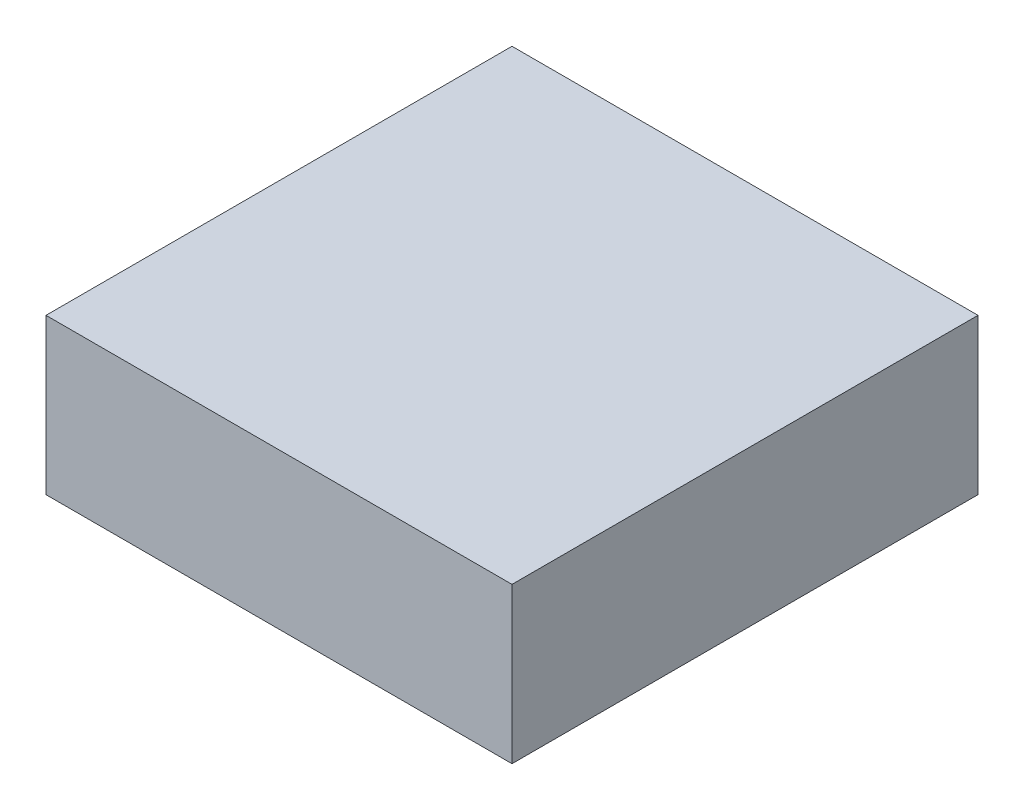
ISO-10303-21;
HEADER;
FILE_DESCRIPTION(('STEP AP214'),'2;1');
FILE_NAME('part.step','',(''),(''),'','','');
FILE_SCHEMA(('AUTOMOTIVE_DESIGN { 1 0 10303 214 1 1 1 1 }'));
ENDSEC;
DATA;
#1=APPLICATION_CONTEXT('core data for automotive mechanical design processes');
#2=APPLICATION_PROTOCOL_DEFINITION('international standard','automotive_design',2000,#1);
#3=PRODUCT_CONTEXT('',#1,'mechanical');
#4=PRODUCT('Part','Part','',(#3));
#5=PRODUCT_RELATED_PRODUCT_CATEGORY('part','',(#4));
#6=PRODUCT_DEFINITION_FORMATION('','',#4);
#7=PRODUCT_DEFINITION_CONTEXT('part definition',#1,'design');
#8=PRODUCT_DEFINITION('design','',#6,#7);
#9=PRODUCT_DEFINITION_SHAPE('','',#8);
#10=(LENGTH_UNIT() NAMED_UNIT(*) SI_UNIT(.MILLI.,.METRE.));
#11=(NAMED_UNIT(*) PLANE_ANGLE_UNIT() SI_UNIT($,.RADIAN.));
#12=(NAMED_UNIT(*) SI_UNIT($,.STERADIAN.) SOLID_ANGLE_UNIT());
#13=UNCERTAINTY_MEASURE_WITH_UNIT(LENGTH_MEASURE(1.E-05),#10,'distance_accuracy_value','');
#14=(GEOMETRIC_REPRESENTATION_CONTEXT(3) GLOBAL_UNCERTAINTY_ASSIGNED_CONTEXT((#13)) GLOBAL_UNIT_ASSIGNED_CONTEXT((#10,
#11,#12)) REPRESENTATION_CONTEXT('',''));
#15=CARTESIAN_POINT('',(0.,0.,0.));
#16=DIRECTION('',(0.,0.,1.));
#17=DIRECTION('',(1.,0.,0.));
#18=AXIS2_PLACEMENT_3D('',#15,#16,#17);
#19=CARTESIAN_POINT('',(7.5,5.,7.5));
#20=DIRECTION('',(-1.,0.,0.));
#21=DIRECTION('',(0.,0.,1.));
#22=AXIS2_PLACEMENT_3D('',#19,#20,#21);
#23=PLANE('',#22);
#24=DIRECTION('',(0.,0.,-1.));
#25=VECTOR('',#24,1.);
#26=CARTESIAN_POINT('',(7.5,0.,7.5));
#27=LINE('',#26,#25);
#28=CARTESIAN_POINT('',(7.5,0.,7.5));
#29=VERTEX_POINT('',#28);
#30=CARTESIAN_POINT('',(7.5,0.,-7.5));
#31=VERTEX_POINT('',#30);
#32=EDGE_CURVE('E111',#29,#31,#27,.T.);
#33=ORIENTED_EDGE('',*,*,#32,.T.);
#34=DIRECTION('',(0.,-1.,0.));
#35=VECTOR('',#34,1.);
#36=CARTESIAN_POINT('',(7.5,5.,-7.5));
#37=LINE('',#36,#35);
#38=CARTESIAN_POINT('',(7.5,5.,-7.5));
#39=VERTEX_POINT('',#38);
#40=EDGE_CURVE('E11',#39,#31,#37,.T.);
#41=ORIENTED_EDGE('',*,*,#40,.F.);
#42=DIRECTION('',(0.,0.,-1.));
#43=VECTOR('',#42,1.);
#44=CARTESIAN_POINT('',(7.5,5.,7.5));
#45=LINE('',#44,#43);
#46=CARTESIAN_POINT('',(7.5,5.,7.5));
#47=VERTEX_POINT('',#46);
#48=EDGE_CURVE('E95',#47,#39,#45,.T.);
#49=ORIENTED_EDGE('',*,*,#48,.F.);
#50=DIRECTION('',(0.,-1.,0.));
#51=VECTOR('',#50,1.);
#52=CARTESIAN_POINT('',(7.5,5.,7.5));
#53=LINE('',#52,#51);
#54=EDGE_CURVE('E107',#47,#29,#53,.T.);
#55=ORIENTED_EDGE('',*,*,#54,.T.);
#56=EDGE_LOOP('',(#33,#41,#49,#55));
#57=FACE_BOUND('',#56,.T.);
#58=ADVANCED_FACE('F43',(#57),#23,.F.);
#59=CARTESIAN_POINT('',(-7.5,5.,-7.5));
#60=DIRECTION('',(0.,0.,1.));
#61=DIRECTION('',(1.,0.,0.));
#62=AXIS2_PLACEMENT_3D('',#59,#60,#61);
#63=PLANE('',#62);
#64=DIRECTION('',(-1.,0.,0.));
#65=VECTOR('',#64,1.);
#66=CARTESIAN_POINT('',(-7.5,0.,-7.5));
#67=LINE('',#66,#65);
#68=CARTESIAN_POINT('',(-7.5,0.,-7.5));
#69=VERTEX_POINT('',#68);
#70=EDGE_CURVE('E100',#31,#69,#67,.T.);
#71=ORIENTED_EDGE('',*,*,#70,.T.);
#72=DIRECTION('',(0.,-1.,0.));
#73=VECTOR('',#72,1.);
#74=CARTESIAN_POINT('',(-7.5,5.,-7.5));
#75=LINE('',#74,#73);
#76=CARTESIAN_POINT('',(-7.5,5.,-7.5));
#77=VERTEX_POINT('',#76);
#78=EDGE_CURVE('E52',#77,#69,#75,.T.);
#79=ORIENTED_EDGE('',*,*,#78,.F.);
#80=DIRECTION('',(-1.,0.,0.));
#81=VECTOR('',#80,1.);
#82=CARTESIAN_POINT('',(-7.5,5.,-7.5));
#83=LINE('',#82,#81);
#84=EDGE_CURVE('E90',#39,#77,#83,.T.);
#85=ORIENTED_EDGE('',*,*,#84,.F.);
#86=ORIENTED_EDGE('',*,*,#40,.T.);
#87=EDGE_LOOP('',(#71,#79,#85,#86));
#88=FACE_BOUND('',#87,.T.);
#89=ADVANCED_FACE('F99',(#88),#63,.F.);
#90=CARTESIAN_POINT('',(-7.5,5.,7.5));
#91=DIRECTION('',(1.,0.,0.));
#92=DIRECTION('',(0.,0.,-1.));
#93=AXIS2_PLACEMENT_3D('',#90,#91,#92);
#94=PLANE('',#93);
#95=DIRECTION('',(0.,0.,1.));
#96=VECTOR('',#95,1.);
#97=CARTESIAN_POINT('',(-7.5,0.,7.5));
#98=LINE('',#97,#96);
#99=CARTESIAN_POINT('',(-7.5,0.,7.5));
#100=VERTEX_POINT('',#99);
#101=EDGE_CURVE('E77',#69,#100,#98,.T.);
#102=ORIENTED_EDGE('',*,*,#101,.T.);
#103=DIRECTION('',(0.,-1.,0.));
#104=VECTOR('',#103,1.);
#105=CARTESIAN_POINT('',(-7.5,5.,7.5));
#106=LINE('',#105,#104);
#107=CARTESIAN_POINT('',(-7.5,5.,7.5));
#108=VERTEX_POINT('',#107);
#109=EDGE_CURVE('E102',#108,#100,#106,.T.);
#110=ORIENTED_EDGE('',*,*,#109,.F.);
#111=DIRECTION('',(0.,0.,1.));
#112=VECTOR('',#111,1.);
#113=CARTESIAN_POINT('',(-7.5,5.,7.5));
#114=LINE('',#113,#112);
#115=EDGE_CURVE('E93',#77,#108,#114,.T.);
#116=ORIENTED_EDGE('',*,*,#115,.F.);
#117=ORIENTED_EDGE('',*,*,#78,.T.);
#118=EDGE_LOOP('',(#102,#110,#116,#117));
#119=FACE_BOUND('',#118,.T.);
#120=ADVANCED_FACE('F103',(#119),#94,.F.);
#121=CARTESIAN_POINT('',(-7.5,5.,7.5));
#122=DIRECTION('',(0.,0.,-1.));
#123=DIRECTION('',(-1.,0.,0.));
#124=AXIS2_PLACEMENT_3D('',#121,#122,#123);
#125=PLANE('',#124);
#126=DIRECTION('',(1.,0.,0.));
#127=VECTOR('',#126,1.);
#128=CARTESIAN_POINT('',(-7.5,0.,7.5));
#129=LINE('',#128,#127);
#130=EDGE_CURVE('E83',#100,#29,#129,.T.);
#131=ORIENTED_EDGE('',*,*,#130,.T.);
#132=ORIENTED_EDGE('',*,*,#54,.F.);
#133=DIRECTION('',(1.,0.,0.));
#134=VECTOR('',#133,1.);
#135=CARTESIAN_POINT('',(-7.5,5.,7.5));
#136=LINE('',#135,#134);
#137=EDGE_CURVE('E60',#108,#47,#136,.T.);
#138=ORIENTED_EDGE('',*,*,#137,.F.);
#139=ORIENTED_EDGE('',*,*,#109,.T.);
#140=EDGE_LOOP('',(#131,#132,#138,#139));
#141=FACE_BOUND('',#140,.T.);
#142=ADVANCED_FACE('F124',(#141),#125,.F.);
#143=CARTESIAN_POINT('',(0.,5.,0.));
#144=DIRECTION('',(0.,-1.,0.));
#145=DIRECTION('',(0.,0.,-1.));
#146=AXIS2_PLACEMENT_3D('',#143,#144,#145);
#147=PLANE('',#146);
#148=ORIENTED_EDGE('',*,*,#48,.T.);
#149=ORIENTED_EDGE('',*,*,#84,.T.);
#150=ORIENTED_EDGE('',*,*,#115,.T.);
#151=ORIENTED_EDGE('',*,*,#137,.T.);
#152=EDGE_LOOP('',(#148,#149,#150,#151));
#153=FACE_BOUND('',#152,.T.);
#154=ADVANCED_FACE('F91',(#153),#147,.F.);
#155=CARTESIAN_POINT('',(0.,0.,0.));
#156=DIRECTION('',(0.,-1.,0.));
#157=DIRECTION('',(0.,0.,-1.));
#158=AXIS2_PLACEMENT_3D('',#155,#156,#157);
#159=PLANE('',#158);
#160=ORIENTED_EDGE('',*,*,#32,.F.);
#161=ORIENTED_EDGE('',*,*,#130,.F.);
#162=ORIENTED_EDGE('',*,*,#101,.F.);
#163=ORIENTED_EDGE('',*,*,#70,.F.);
#164=EDGE_LOOP('',(#160,#161,#162,#163));
#165=FACE_BOUND('',#164,.T.);
#166=ADVANCED_FACE('F127',(#165),#159,.T.);
#167=CLOSED_SHELL('',(#58,#89,#120,#142,#154,#166));
#168=MANIFOLD_SOLID_BREP('B2',#167);
#169=ADVANCED_BREP_SHAPE_REPRESENTATION('',(#18,#168),#14);
#170=SHAPE_DEFINITION_REPRESENTATION(#9,#169);
ENDSEC;
END-ISO-10303-21;
